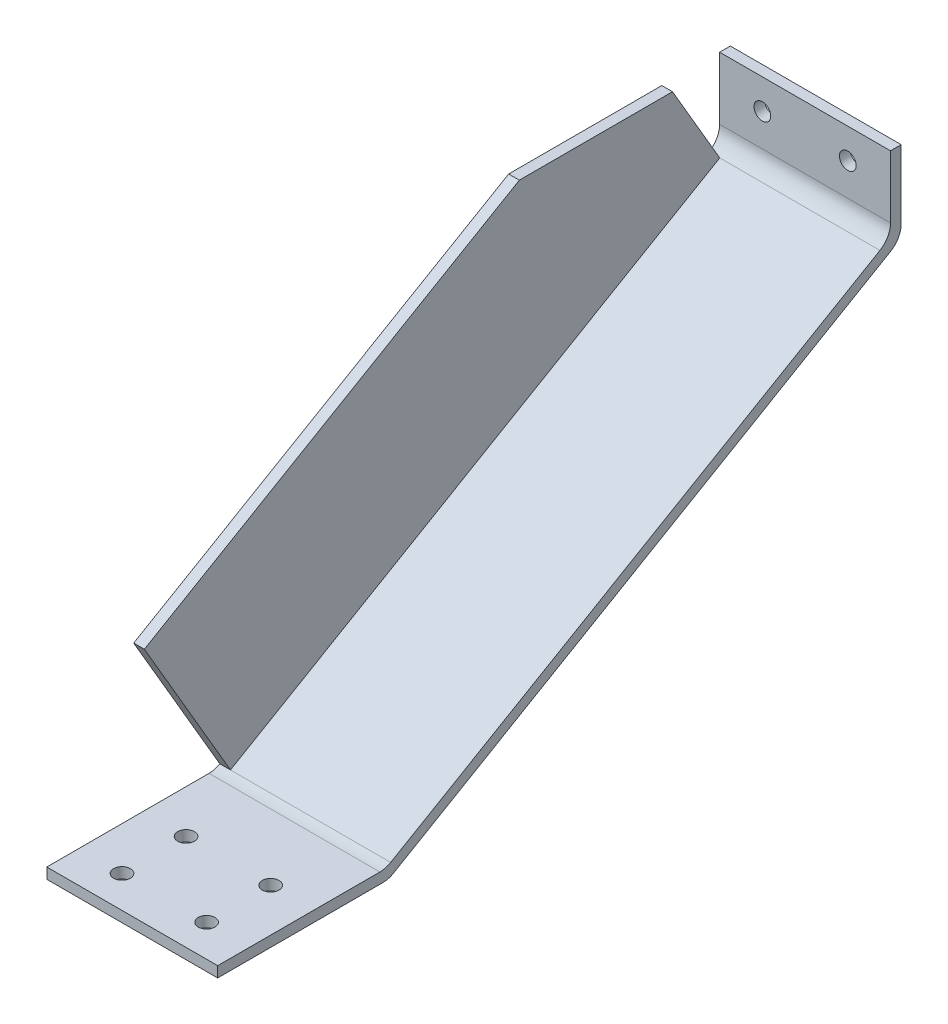
ISO-10303-21;
HEADER;
FILE_DESCRIPTION(('STEP AP214'),'2;1');
FILE_NAME('part.step','',(''),(''),'','','');
FILE_SCHEMA(('AUTOMOTIVE_DESIGN { 1 0 10303 214 1 1 1 1 }'));
ENDSEC;
DATA;
#1=APPLICATION_CONTEXT('core data for automotive mechanical design processes');
#2=APPLICATION_PROTOCOL_DEFINITION('international standard','automotive_design',2000,#1);
#3=PRODUCT_CONTEXT('',#1,'mechanical');
#4=PRODUCT('Part','Part','',(#3));
#5=PRODUCT_RELATED_PRODUCT_CATEGORY('part','',(#4));
#6=PRODUCT_DEFINITION_FORMATION('','',#4);
#7=PRODUCT_DEFINITION_CONTEXT('part definition',#1,'design');
#8=PRODUCT_DEFINITION('design','',#6,#7);
#9=PRODUCT_DEFINITION_SHAPE('','',#8);
#10=(LENGTH_UNIT() NAMED_UNIT(*) SI_UNIT(.MILLI.,.METRE.));
#11=(NAMED_UNIT(*) PLANE_ANGLE_UNIT() SI_UNIT($,.RADIAN.));
#12=(NAMED_UNIT(*) SI_UNIT($,.STERADIAN.) SOLID_ANGLE_UNIT());
#13=UNCERTAINTY_MEASURE_WITH_UNIT(LENGTH_MEASURE(1.E-05),#10,'distance_accuracy_value','');
#14=(GEOMETRIC_REPRESENTATION_CONTEXT(3) GLOBAL_UNCERTAINTY_ASSIGNED_CONTEXT((#13)) GLOBAL_UNIT_ASSIGNED_CONTEXT((#10,
#11,#12)) REPRESENTATION_CONTEXT('',''));
#15=CARTESIAN_POINT('',(0.,0.,0.));
#16=DIRECTION('',(0.,0.,1.));
#17=DIRECTION('',(1.,0.,0.));
#18=AXIS2_PLACEMENT_3D('',#15,#16,#17);
#19=CARTESIAN_POINT('',(3.175,0.,0.));
#20=DIRECTION('',(1.,0.,0.));
#21=DIRECTION('',(0.,0.,-1.));
#22=AXIS2_PLACEMENT_3D('',#19,#20,#21);
#23=PLANE('',#22);
#24=DIRECTION('',(0.,0.503871025524211,-0.863778900898361));
#25=VECTOR('',#24,1.);
#26=CARTESIAN_POINT('',(3.175,47.9199721449,177.372142656));
#27=LINE('',#26,#25);
#28=CARTESIAN_POINT('',(3.175,112.948625805791,65.8944506661171));
#29=VERTEX_POINT('',#28);
#30=CARTESIAN_POINT('',(3.175,47.9199721450679,177.372142655712));
#31=VERTEX_POINT('',#30);
#32=EDGE_CURVE('E233',#29,#31,#27,.F.);
#33=ORIENTED_EDGE('',*,*,#32,.T.);
#34=DIRECTION('',(0.,0.863778900898361,0.503871025524211));
#35=VECTOR('',#34,1.);
#36=CARTESIAN_POINT('',(3.175,4.04000397929,151.775494559));
#37=LINE('',#36,#35);
#38=CARTESIAN_POINT('',(3.175,4.04000397929314,151.775494559002));
#39=VERTEX_POINT('',#38);
#40=EDGE_CURVE('E220',#31,#39,#37,.F.);
#41=ORIENTED_EDGE('',*,*,#40,.T.);
#42=DIRECTION('',(0.,-0.503871025524211,0.863778900898361));
#43=VECTOR('',#42,1.);
#44=CARTESIAN_POINT('',(3.175,90.7236258055,3.175));
#45=LINE('',#44,#43);
#46=CARTESIAN_POINT('',(3.175,88.8858813959284,6.3254189878575));
#47=VERTEX_POINT('',#46);
#48=EDGE_CURVE('E104',#47,#39,#45,.T.);
#49=ORIENTED_EDGE('',*,*,#48,.F.);
#50=DIRECTION('',(0.,-0.863778900898361,-0.503871025524211));
#51=VECTOR('',#50,1.);
#52=CARTESIAN_POINT('',(3.175,112.948625806,20.3620198935));
#53=LINE('',#52,#51);
#54=CARTESIAN_POINT('',(3.175,112.948625806,20.3620198935));
#55=VERTEX_POINT('',#54);
#56=EDGE_CURVE('E244',#47,#55,#53,.F.);
#57=ORIENTED_EDGE('',*,*,#56,.T.);
#58=DIRECTION('',(0.,0.,1.));
#59=VECTOR('',#58,1.);
#60=CARTESIAN_POINT('',(3.175,112.948625806,0.));
#61=LINE('',#60,#59);
#62=EDGE_CURVE('E243',#29,#55,#61,.F.);
#63=ORIENTED_EDGE('',*,*,#62,.F.);
#64=EDGE_LOOP('',(#33,#41,#49,#57,#63));
#65=FACE_BOUND('',#64,.T.);
#66=ADVANCED_FACE('F17',(#65),#23,.T.);
#67=CARTESIAN_POINT('',(12.827,0.927499999389,174.625));
#68=DIRECTION('',(0.,1.,0.));
#69=DIRECTION('',(0.,0.,1.));
#70=AXIS2_PLACEMENT_3D('',#67,#68,#69);
#71=CYLINDRICAL_SURFACE('',#70,2.4892);
#72=CARTESIAN_POINT('',(12.827,3.175,174.625));
#73=DIRECTION('',(0.,1.,0.));
#74=DIRECTION('',(0.,0.,1.));
#75=AXIS2_PLACEMENT_3D('',#72,#73,#74);
#76=CIRCLE('',#75,2.4892);
#77=CARTESIAN_POINT('',(12.827,3.175,177.1142));
#78=VERTEX_POINT('',#77);
#79=EDGE_CURVE('E209',#78,#78,#76,.F.);
#80=ORIENTED_EDGE('',*,*,#79,.F.);
#81=EDGE_LOOP('',(#80));
#82=FACE_BOUND('',#81,.T.);
#83=CARTESIAN_POINT('',(12.827,0.,174.625));
#84=DIRECTION('',(0.,1.,0.));
#85=DIRECTION('',(0.,0.,1.));
#86=AXIS2_PLACEMENT_3D('',#83,#84,#85);
#87=CIRCLE('',#86,2.4892);
#88=CARTESIAN_POINT('',(12.827,0.,177.1142));
#89=VERTEX_POINT('',#88);
#90=EDGE_CURVE('E190',#89,#89,#87,.T.);
#91=ORIENTED_EDGE('',*,*,#90,.F.);
#92=EDGE_LOOP('',(#91));
#93=FACE_BOUND('',#92,.T.);
#94=ADVANCED_FACE('F335',(#82,#93),#71,.F.);
#95=CARTESIAN_POINT('',(12.827,0.927499999389,193.675));
#96=DIRECTION('',(0.,1.,0.));
#97=DIRECTION('',(0.,0.,1.));
#98=AXIS2_PLACEMENT_3D('',#95,#96,#97);
#99=CYLINDRICAL_SURFACE('',#98,2.4892);
#100=CARTESIAN_POINT('',(12.827,3.175,193.675));
#101=DIRECTION('',(0.,1.,0.));
#102=DIRECTION('',(0.,0.,1.));
#103=AXIS2_PLACEMENT_3D('',#100,#101,#102);
#104=CIRCLE('',#103,2.4892);
#105=CARTESIAN_POINT('',(12.827,3.175,196.1642));
#106=VERTEX_POINT('',#105);
#107=EDGE_CURVE('E327',#106,#106,#104,.F.);
#108=ORIENTED_EDGE('',*,*,#107,.F.);
#109=EDGE_LOOP('',(#108));
#110=FACE_BOUND('',#109,.T.);
#111=CARTESIAN_POINT('',(12.827,0.,193.675));
#112=DIRECTION('',(0.,1.,0.));
#113=DIRECTION('',(0.,0.,1.));
#114=AXIS2_PLACEMENT_3D('',#111,#112,#113);
#115=CIRCLE('',#114,2.4892);
#116=CARTESIAN_POINT('',(12.827,0.,196.1642));
#117=VERTEX_POINT('',#116);
#118=EDGE_CURVE('E317',#117,#117,#115,.T.);
#119=ORIENTED_EDGE('',*,*,#118,.F.);
#120=EDGE_LOOP('',(#119));
#121=FACE_BOUND('',#120,.T.);
#122=ADVANCED_FACE('F338',(#110,#121),#99,.F.);
#123=CARTESIAN_POINT('',(37.973,0.927499999389,193.675));
#124=DIRECTION('',(0.,1.,0.));
#125=DIRECTION('',(0.,0.,1.));
#126=AXIS2_PLACEMENT_3D('',#123,#124,#125);
#127=CYLINDRICAL_SURFACE('',#126,2.4892);
#128=CARTESIAN_POINT('',(37.973,3.175,193.675));
#129=DIRECTION('',(0.,1.,0.));
#130=DIRECTION('',(0.,0.,1.));
#131=AXIS2_PLACEMENT_3D('',#128,#129,#130);
#132=CIRCLE('',#131,2.4892);
#133=CARTESIAN_POINT('',(37.973,3.175,196.1642));
#134=VERTEX_POINT('',#133);
#135=EDGE_CURVE('E324',#134,#134,#132,.F.);
#136=ORIENTED_EDGE('',*,*,#135,.F.);
#137=EDGE_LOOP('',(#136));
#138=FACE_BOUND('',#137,.T.);
#139=CARTESIAN_POINT('',(37.973,0.,193.675));
#140=DIRECTION('',(0.,1.,0.));
#141=DIRECTION('',(0.,0.,1.));
#142=AXIS2_PLACEMENT_3D('',#139,#140,#141);
#143=CIRCLE('',#142,2.4892);
#144=CARTESIAN_POINT('',(37.973,0.,196.1642));
#145=VERTEX_POINT('',#144);
#146=EDGE_CURVE('E314',#145,#145,#143,.T.);
#147=ORIENTED_EDGE('',*,*,#146,.F.);
#148=EDGE_LOOP('',(#147));
#149=FACE_BOUND('',#148,.T.);
#150=ADVANCED_FACE('F603',(#138,#149),#127,.F.);
#151=CARTESIAN_POINT('',(37.973,0.927499999389,174.625));
#152=DIRECTION('',(0.,1.,0.));
#153=DIRECTION('',(0.,0.,1.));
#154=AXIS2_PLACEMENT_3D('',#151,#152,#153);
#155=CYLINDRICAL_SURFACE('',#154,2.4892);
#156=CARTESIAN_POINT('',(37.973,3.175,174.625));
#157=DIRECTION('',(0.,1.,0.));
#158=DIRECTION('',(0.,0.,1.));
#159=AXIS2_PLACEMENT_3D('',#156,#157,#158);
#160=CIRCLE('',#159,2.4892);
#161=CARTESIAN_POINT('',(37.973,3.175,177.1142));
#162=VERTEX_POINT('',#161);
#163=EDGE_CURVE('E204',#162,#162,#160,.F.);
#164=ORIENTED_EDGE('',*,*,#163,.F.);
#165=EDGE_LOOP('',(#164));
#166=FACE_BOUND('',#165,.T.);
#167=CARTESIAN_POINT('',(37.973,0.,174.625));
#168=DIRECTION('',(0.,1.,0.));
#169=DIRECTION('',(0.,0.,1.));
#170=AXIS2_PLACEMENT_3D('',#167,#168,#169);
#171=CIRCLE('',#170,2.4892);
#172=CARTESIAN_POINT('',(37.973,0.,177.1142));
#173=VERTEX_POINT('',#172);
#174=EDGE_CURVE('E311',#173,#173,#171,.T.);
#175=ORIENTED_EDGE('',*,*,#174,.F.);
#176=EDGE_LOOP('',(#175));
#177=FACE_BOUND('',#176,.T.);
#178=ADVANCED_FACE('F594',(#166,#177),#155,.F.);
#179=CARTESIAN_POINT('',(12.7,104.043701172,0.927499998937));
#180=DIRECTION('',(0.,0.,1.));
#181=DIRECTION('',(1.,0.,0.));
#182=AXIS2_PLACEMENT_3D('',#179,#180,#181);
#183=CYLINDRICAL_SURFACE('',#182,2.4892);
#184=CARTESIAN_POINT('',(12.7,104.043701172,3.175));
#185=DIRECTION('',(0.,0.,1.));
#186=DIRECTION('',(1.,0.,0.));
#187=AXIS2_PLACEMENT_3D('',#184,#185,#186);
#188=CIRCLE('',#187,2.4892);
#189=CARTESIAN_POINT('',(15.1892,104.043701172,3.175));
#190=VERTEX_POINT('',#189);
#191=EDGE_CURVE('E158',#190,#190,#188,.F.);
#192=ORIENTED_EDGE('',*,*,#191,.F.);
#193=EDGE_LOOP('',(#192));
#194=FACE_BOUND('',#193,.T.);
#195=CARTESIAN_POINT('',(12.7,104.043701172,0.));
#196=DIRECTION('',(0.,0.,1.));
#197=DIRECTION('',(1.,0.,0.));
#198=AXIS2_PLACEMENT_3D('',#195,#196,#197);
#199=CIRCLE('',#198,2.4892);
#200=CARTESIAN_POINT('',(15.1892,104.043701172,0.));
#201=VERTEX_POINT('',#200);
#202=EDGE_CURVE('E178',#201,#201,#199,.T.);
#203=ORIENTED_EDGE('',*,*,#202,.F.);
#204=EDGE_LOOP('',(#203));
#205=FACE_BOUND('',#204,.T.);
#206=ADVANCED_FACE('F585',(#194,#205),#183,.F.);
#207=CARTESIAN_POINT('',(38.1,104.043701172,0.927499998937));
#208=DIRECTION('',(0.,0.,1.));
#209=DIRECTION('',(1.,0.,0.));
#210=AXIS2_PLACEMENT_3D('',#207,#208,#209);
#211=CYLINDRICAL_SURFACE('',#210,2.4892);
#212=CARTESIAN_POINT('',(38.1,104.043701172,3.175));
#213=DIRECTION('',(0.,0.,1.));
#214=DIRECTION('',(1.,0.,0.));
#215=AXIS2_PLACEMENT_3D('',#212,#213,#214);
#216=CIRCLE('',#215,2.4892);
#217=CARTESIAN_POINT('',(40.5892,104.043701172,3.175));
#218=VERTEX_POINT('',#217);
#219=EDGE_CURVE('E161',#218,#218,#216,.F.);
#220=ORIENTED_EDGE('',*,*,#219,.F.);
#221=EDGE_LOOP('',(#220));
#222=FACE_BOUND('',#221,.T.);
#223=CARTESIAN_POINT('',(38.1,104.043701172,0.));
#224=DIRECTION('',(0.,0.,1.));
#225=DIRECTION('',(1.,0.,0.));
#226=AXIS2_PLACEMENT_3D('',#223,#224,#225);
#227=CIRCLE('',#226,2.4892);
#228=CARTESIAN_POINT('',(40.5892,104.043701172,0.));
#229=VERTEX_POINT('',#228);
#230=EDGE_CURVE('E173',#229,#229,#227,.T.);
#231=ORIENTED_EDGE('',*,*,#230,.F.);
#232=EDGE_LOOP('',(#231));
#233=FACE_BOUND('',#232,.T.);
#234=ADVANCED_FACE('F434',(#222,#233),#211,.F.);
#235=CARTESIAN_POINT('',(50.8,0.,0.));
#236=DIRECTION('',(1.,0.,0.));
#237=DIRECTION('',(0.,0.,-1.));
#238=AXIS2_PLACEMENT_3D('',#235,#236,#237);
#239=PLANE('',#238);
#240=DIRECTION('',(0.,0.503871025524211,-0.863778900898361));
#241=VECTOR('',#240,1.);
#242=CARTESIAN_POINT('',(50.8,0.,152.4));
#243=LINE('',#242,#241);
#244=CARTESIAN_POINT('',(50.8,87.062255590401,3.15041898792254));
#245=VERTEX_POINT('',#244);
#246=CARTESIAN_POINT('',(50.8,0.865003979309899,150.917136035469));
#247=VERTEX_POINT('',#246);
#248=EDGE_CURVE('E184',#245,#247,#243,.F.);
#249=ORIENTED_EDGE('',*,*,#248,.F.);
#250=CARTESIAN_POINT('',(50.8,92.5472516111,6.35));
#251=DIRECTION('',(1.,0.,0.));
#252=DIRECTION('',(0.,0.,-1.));
#253=AXIS2_PLACEMENT_3D('',#250,#251,#252);
#254=CIRCLE('',#253,6.35);
#255=CARTESIAN_POINT('',(50.8,92.5472516111,0.));
#256=VERTEX_POINT('',#255);
#257=EDGE_CURVE('E181',#256,#245,#254,.F.);
#258=ORIENTED_EDGE('',*,*,#257,.F.);
#259=DIRECTION('',(0.,1.,0.));
#260=VECTOR('',#259,1.);
#261=CARTESIAN_POINT('',(50.8,88.9,0.));
#262=LINE('',#261,#260);
#263=CARTESIAN_POINT('',(50.8,112.948625806,0.));
#264=VERTEX_POINT('',#263);
#265=EDGE_CURVE('E149',#264,#256,#262,.F.);
#266=ORIENTED_EDGE('',*,*,#265,.F.);
#267=DIRECTION('',(0.,0.,1.));
#268=VECTOR('',#267,1.);
#269=CARTESIAN_POINT('',(50.8,112.948625806,0.));
#270=LINE('',#269,#268);
#271=CARTESIAN_POINT('',(50.8,112.948625806,3.175));
#272=VERTEX_POINT('',#271);
#273=EDGE_CURVE('E143',#272,#264,#270,.F.);
#274=ORIENTED_EDGE('',*,*,#273,.F.);
#275=DIRECTION('',(0.,1.,0.));
#276=VECTOR('',#275,1.);
#277=CARTESIAN_POINT('',(50.8,112.948625806,3.175));
#278=LINE('',#277,#276);
#279=CARTESIAN_POINT('',(50.8,94.3708774166,3.175));
#280=VERTEX_POINT('',#279);
#281=EDGE_CURVE('E136',#280,#272,#278,.T.);
#282=ORIENTED_EDGE('',*,*,#281,.F.);
#283=CARTESIAN_POINT('',(50.8,94.3708774166,9.525));
#284=DIRECTION('',(1.,0.,0.));
#285=DIRECTION('',(0.,0.,-1.));
#286=AXIS2_PLACEMENT_3D('',#283,#284,#285);
#287=CIRCLE('',#286,6.35);
#288=CARTESIAN_POINT('',(50.8,88.88588139589,6.32541898791615));
#289=VERTEX_POINT('',#288);
#290=EDGE_CURVE('E253',#280,#289,#287,.F.);
#291=ORIENTED_EDGE('',*,*,#290,.T.);
#292=DIRECTION('',(0.,-0.503871025524211,0.863778900898361));
#293=VECTOR('',#292,1.);
#294=CARTESIAN_POINT('',(50.8,90.7236258055,3.175));
#295=LINE('',#294,#293);
#296=CARTESIAN_POINT('',(50.8,4.04000397932926,151.775494558982));
#297=VERTEX_POINT('',#296);
#298=EDGE_CURVE('E94',#297,#289,#295,.F.);
#299=ORIENTED_EDGE('',*,*,#298,.F.);
#300=CARTESIAN_POINT('',(50.8,9.525,154.975075571));
#301=DIRECTION('',(1.,0.,0.));
#302=DIRECTION('',(0.,0.,-1.));
#303=AXIS2_PLACEMENT_3D('',#300,#301,#302);
#304=CIRCLE('',#303,6.35);
#305=CARTESIAN_POINT('',(50.8,3.175,154.975075571));
#306=VERTEX_POINT('',#305);
#307=EDGE_CURVE('E20',#297,#306,#304,.F.);
#308=ORIENTED_EDGE('',*,*,#307,.T.);
#309=DIRECTION('',(0.,0.,1.));
#310=VECTOR('',#309,1.);
#311=CARTESIAN_POINT('',(50.8,3.175,153.258358524));
#312=LINE('',#311,#310);
#313=CARTESIAN_POINT('',(50.8,3.175,203.2));
#314=VERTEX_POINT('',#313);
#315=EDGE_CURVE('E210',#314,#306,#312,.F.);
#316=ORIENTED_EDGE('',*,*,#315,.F.);
#317=DIRECTION('',(0.,1.,0.));
#318=VECTOR('',#317,1.);
#319=CARTESIAN_POINT('',(50.8,3.175,203.2));
#320=LINE('',#319,#318);
#321=CARTESIAN_POINT('',(50.8,0.,203.2));
#322=VERTEX_POINT('',#321);
#323=EDGE_CURVE('E203',#322,#314,#320,.T.);
#324=ORIENTED_EDGE('',*,*,#323,.F.);
#325=DIRECTION('',(0.,0.,-1.));
#326=VECTOR('',#325,1.);
#327=CARTESIAN_POINT('',(50.8,0.,203.2));
#328=LINE('',#327,#326);
#329=CARTESIAN_POINT('',(50.8,0.,154.116717048));
#330=VERTEX_POINT('',#329);
#331=EDGE_CURVE('E191',#330,#322,#328,.F.);
#332=ORIENTED_EDGE('',*,*,#331,.F.);
#333=CARTESIAN_POINT('',(50.8,6.35,154.116717048));
#334=DIRECTION('',(1.,0.,0.));
#335=DIRECTION('',(0.,0.,-1.));
#336=AXIS2_PLACEMENT_3D('',#333,#334,#335);
#337=CIRCLE('',#336,6.35);
#338=EDGE_CURVE('E187',#247,#330,#337,.F.);
#339=ORIENTED_EDGE('',*,*,#338,.F.);
#340=EDGE_LOOP('',(#249,#258,#266,#274,#282,#291,#299,#308,#316,#324,#332,#339));
#341=FACE_BOUND('',#340,.T.);
#342=ADVANCED_FACE('F147',(#341),#239,.T.);
#343=CARTESIAN_POINT('',(0.,90.7236258055,3.175));
#344=DIRECTION('',(0.,0.863778900898361,0.503871025524211));
#345=DIRECTION('',(0.,-0.503871025524211,0.863778900898361));
#346=AXIS2_PLACEMENT_3D('',#343,#344,#345);
#347=PLANE('',#346);
#348=DIRECTION('',(1.,0.,0.));
#349=VECTOR('',#348,1.);
#350=CARTESIAN_POINT('',(25.4,88.8858813958971,6.32541898791832));
#351=LINE('',#350,#349);
#352=EDGE_CURVE('E250',#289,#47,#351,.F.);
#353=ORIENTED_EDGE('',*,*,#352,.T.);
#354=ORIENTED_EDGE('',*,*,#48,.T.);
#355=DIRECTION('',(1.,0.,0.));
#356=VECTOR('',#355,1.);
#357=CARTESIAN_POINT('',(25.4,4.04000397925975,151.775494558982));
#358=LINE('',#357,#356);
#359=EDGE_CURVE('E214',#39,#297,#358,.T.);
#360=ORIENTED_EDGE('',*,*,#359,.T.);
#361=ORIENTED_EDGE('',*,*,#298,.T.);
#362=EDGE_LOOP('',(#353,#354,#360,#361));
#363=FACE_BOUND('',#362,.T.);
#364=ADVANCED_FACE('F425',(#363),#347,.T.);
#365=CARTESIAN_POINT('',(0.,112.948625806,20.3620198935));
#366=DIRECTION('',(0.,-0.503871025524211,0.863778900898361));
#367=DIRECTION('',(0.,-0.863778900898361,-0.503871025524211));
#368=AXIS2_PLACEMENT_3D('',#365,#366,#367);
#369=PLANE('',#368);
#370=DIRECTION('',(0.,0.863778900903303,0.503871025515739));
#371=VECTOR('',#370,1.);
#372=CARTESIAN_POINT('',(0.,88.8858813959,6.32541898792));
#373=LINE('',#372,#371);
#374=CARTESIAN_POINT('',(0.,88.8858813958971,6.32541898791832));
#375=VERTEX_POINT('',#374);
#376=CARTESIAN_POINT('',(0.,112.948625806,20.3620198935));
#377=VERTEX_POINT('',#376);
#378=EDGE_CURVE('E238',#375,#377,#373,.T.);
#379=ORIENTED_EDGE('',*,*,#378,.T.);
#380=DIRECTION('',(1.,0.,0.));
#381=VECTOR('',#380,1.);
#382=CARTESIAN_POINT('',(0.,112.948625806,20.3620198935));
#383=LINE('',#382,#381);
#384=EDGE_CURVE('E241',#55,#377,#383,.F.);
#385=ORIENTED_EDGE('',*,*,#384,.F.);
#386=ORIENTED_EDGE('',*,*,#56,.F.);
#387=DIRECTION('',(1.,0.,0.));
#388=VECTOR('',#387,1.);
#389=CARTESIAN_POINT('',(25.4,88.8858813958971,6.32541898791832));
#390=LINE('',#389,#388);
#391=EDGE_CURVE('E252',#47,#375,#390,.F.);
#392=ORIENTED_EDGE('',*,*,#391,.T.);
#393=EDGE_LOOP('',(#379,#385,#386,#392));
#394=FACE_BOUND('',#393,.T.);
#395=ADVANCED_FACE('F378',(#394),#369,.F.);
#396=CARTESIAN_POINT('',(0.,112.948625806,0.));
#397=DIRECTION('',(0.,1.,0.));
#398=DIRECTION('',(0.,0.,1.));
#399=AXIS2_PLACEMENT_3D('',#396,#397,#398);
#400=PLANE('',#399);
#401=DIRECTION('',(1.,0.,0.));
#402=VECTOR('',#401,1.);
#403=CARTESIAN_POINT('',(0.,112.948625805687,65.8944506661171));
#404=LINE('',#403,#402);
#405=CARTESIAN_POINT('',(0.,112.948625805896,65.8944506662391));
#406=VERTEX_POINT('',#405);
#407=EDGE_CURVE('E230',#406,#29,#404,.T.);
#408=ORIENTED_EDGE('',*,*,#407,.T.);
#409=ORIENTED_EDGE('',*,*,#62,.T.);
#410=ORIENTED_EDGE('',*,*,#384,.T.);
#411=DIRECTION('',(0.,0.,-1.));
#412=VECTOR('',#411,1.);
#413=CARTESIAN_POINT('',(0.,112.948625806,0.));
#414=LINE('',#413,#412);
#415=EDGE_CURVE('E227',#377,#406,#414,.F.);
#416=ORIENTED_EDGE('',*,*,#415,.T.);
#417=EDGE_LOOP('',(#408,#409,#410,#416));
#418=FACE_BOUND('',#417,.T.);
#419=ADVANCED_FACE('F423',(#418),#400,.T.);
#420=CARTESIAN_POINT('',(0.,47.9199721449,177.372142656));
#421=DIRECTION('',(0.,-0.863778900898361,-0.503871025524211));
#422=DIRECTION('',(0.,0.503871025524211,-0.863778900898361));
#423=AXIS2_PLACEMENT_3D('',#420,#421,#422);
#424=PLANE('',#423);
#425=DIRECTION('',(0.,-0.50387102552664,0.863778900896944));
#426=VECTOR('',#425,1.);
#427=CARTESIAN_POINT('',(0.,112.948625806,65.8944506663));
#428=LINE('',#427,#426);
#429=CARTESIAN_POINT('',(0.,47.9199721449559,177.372142655904));
#430=VERTEX_POINT('',#429);
#431=EDGE_CURVE('E223',#406,#430,#428,.T.);
#432=ORIENTED_EDGE('',*,*,#431,.T.);
#433=DIRECTION('',(1.,0.,0.));
#434=VECTOR('',#433,1.);
#435=CARTESIAN_POINT('',(0.,47.9199721450679,177.372142655712));
#436=LINE('',#435,#434);
#437=EDGE_CURVE('E215',#430,#31,#436,.T.);
#438=ORIENTED_EDGE('',*,*,#437,.T.);
#439=ORIENTED_EDGE('',*,*,#32,.F.);
#440=ORIENTED_EDGE('',*,*,#407,.F.);
#441=EDGE_LOOP('',(#432,#438,#439,#440));
#442=FACE_BOUND('',#441,.T.);
#443=ADVANCED_FACE('F420',(#442),#424,.F.);
#444=CARTESIAN_POINT('',(0.,4.04000397929,151.775494559));
#445=DIRECTION('',(0.,0.503871025524211,-0.863778900898361));
#446=DIRECTION('',(0.,0.863778900898361,0.503871025524211));
#447=AXIS2_PLACEMENT_3D('',#444,#445,#446);
#448=PLANE('',#447);
#449=DIRECTION('',(0.,-0.863778900895057,-0.503871025529875));
#450=VECTOR('',#449,1.);
#451=CARTESIAN_POINT('',(0.,47.9199721449,177.372142656));
#452=LINE('',#451,#450);
#453=CARTESIAN_POINT('',(0.,4.04000397925975,151.775494558982));
#454=VERTEX_POINT('',#453);
#455=EDGE_CURVE('E226',#430,#454,#452,.T.);
#456=ORIENTED_EDGE('',*,*,#455,.T.);
#457=DIRECTION('',(1.,0.,0.));
#458=VECTOR('',#457,1.);
#459=CARTESIAN_POINT('',(25.4,4.04000397925975,151.775494558982));
#460=LINE('',#459,#458);
#461=EDGE_CURVE('E211',#454,#39,#460,.T.);
#462=ORIENTED_EDGE('',*,*,#461,.T.);
#463=ORIENTED_EDGE('',*,*,#40,.F.);
#464=ORIENTED_EDGE('',*,*,#437,.F.);
#465=EDGE_LOOP('',(#456,#462,#463,#464));
#466=FACE_BOUND('',#465,.T.);
#467=ADVANCED_FACE('F418',(#466),#448,.F.);
#468=CARTESIAN_POINT('',(25.4,9.525,154.975075571));
#469=DIRECTION('',(1.,0.,0.));
#470=DIRECTION('',(0.,0.,-1.));
#471=AXIS2_PLACEMENT_3D('',#468,#469,#470);
#472=CYLINDRICAL_SURFACE('',#471,6.35);
#473=ORIENTED_EDGE('',*,*,#307,.F.);
#474=ORIENTED_EDGE('',*,*,#359,.F.);
#475=ORIENTED_EDGE('',*,*,#461,.F.);
#476=CARTESIAN_POINT('',(0.,9.525,154.975075571));
#477=DIRECTION('',(1.,0.,0.));
#478=DIRECTION('',(0.,0.,-1.));
#479=AXIS2_PLACEMENT_3D('',#476,#477,#478);
#480=CIRCLE('',#479,6.35);
#481=CARTESIAN_POINT('',(0.,3.175,154.975075571));
#482=VERTEX_POINT('',#481);
#483=EDGE_CURVE('E299',#454,#482,#480,.F.);
#484=ORIENTED_EDGE('',*,*,#483,.T.);
#485=DIRECTION('',(1.,0.,0.));
#486=VECTOR('',#485,1.);
#487=CARTESIAN_POINT('',(0.,3.175,154.975075571));
#488=LINE('',#487,#486);
#489=EDGE_CURVE('E207',#306,#482,#488,.F.);
#490=ORIENTED_EDGE('',*,*,#489,.F.);
#491=EDGE_LOOP('',(#473,#474,#475,#484,#490));
#492=FACE_BOUND('',#491,.T.);
#493=ADVANCED_FACE('F413',(#492),#472,.F.);
#494=CARTESIAN_POINT('',(0.,3.175,153.258358524));
#495=DIRECTION('',(0.,1.,0.));
#496=DIRECTION('',(0.,0.,1.));
#497=AXIS2_PLACEMENT_3D('',#494,#495,#496);
#498=PLANE('',#497);
#499=ORIENTED_EDGE('',*,*,#163,.T.);
#500=EDGE_LOOP('',(#499));
#501=FACE_BOUND('',#500,.T.);
#502=ORIENTED_EDGE('',*,*,#135,.T.);
#503=EDGE_LOOP('',(#502));
#504=FACE_BOUND('',#503,.T.);
#505=ORIENTED_EDGE('',*,*,#107,.T.);
#506=EDGE_LOOP('',(#505));
#507=FACE_BOUND('',#506,.T.);
#508=ORIENTED_EDGE('',*,*,#79,.T.);
#509=EDGE_LOOP('',(#508));
#510=FACE_BOUND('',#509,.T.);
#511=ORIENTED_EDGE('',*,*,#315,.T.);
#512=ORIENTED_EDGE('',*,*,#489,.T.);
#513=DIRECTION('',(0.,0.,-1.));
#514=VECTOR('',#513,1.);
#515=CARTESIAN_POINT('',(0.,3.175,0.));
#516=LINE('',#515,#514);
#517=CARTESIAN_POINT('',(0.,3.175,203.2));
#518=VERTEX_POINT('',#517);
#519=EDGE_CURVE('E198',#482,#518,#516,.F.);
#520=ORIENTED_EDGE('',*,*,#519,.T.);
#521=DIRECTION('',(1.,0.,0.));
#522=VECTOR('',#521,1.);
#523=CARTESIAN_POINT('',(0.,3.175,203.2));
#524=LINE('',#523,#522);
#525=EDGE_CURVE('E201',#314,#518,#524,.F.);
#526=ORIENTED_EDGE('',*,*,#525,.F.);
#527=EDGE_LOOP('',(#511,#512,#520,#526));
#528=FACE_BOUND('',#527,.T.);
#529=ADVANCED_FACE('F332',(#501,#504,#507,#510,#528),#498,.T.);
#530=CARTESIAN_POINT('',(0.,3.175,203.2));
#531=DIRECTION('',(0.,0.,1.));
#532=DIRECTION('',(1.,0.,0.));
#533=AXIS2_PLACEMENT_3D('',#530,#531,#532);
#534=PLANE('',#533);
#535=DIRECTION('',(1.,0.,0.));
#536=VECTOR('',#535,1.);
#537=CARTESIAN_POINT('',(0.,0.,203.2));
#538=LINE('',#537,#536);
#539=CARTESIAN_POINT('',(0.,0.,203.2));
#540=VERTEX_POINT('',#539);
#541=EDGE_CURVE('E188',#322,#540,#538,.F.);
#542=ORIENTED_EDGE('',*,*,#541,.F.);
#543=ORIENTED_EDGE('',*,*,#323,.T.);
#544=ORIENTED_EDGE('',*,*,#525,.T.);
#545=DIRECTION('',(0.,1.,0.));
#546=VECTOR('',#545,1.);
#547=CARTESIAN_POINT('',(0.,0.,203.2));
#548=LINE('',#547,#546);
#549=EDGE_CURVE('E194',#518,#540,#548,.F.);
#550=ORIENTED_EDGE('',*,*,#549,.T.);
#551=EDGE_LOOP('',(#542,#543,#544,#550));
#552=FACE_BOUND('',#551,.T.);
#553=ADVANCED_FACE('F345',(#552),#534,.T.);
#554=CARTESIAN_POINT('',(0.,0.,203.2));
#555=DIRECTION('',(0.,-1.,0.));
#556=DIRECTION('',(0.,0.,-1.));
#557=AXIS2_PLACEMENT_3D('',#554,#555,#556);
#558=PLANE('',#557);
#559=ORIENTED_EDGE('',*,*,#174,.T.);
#560=EDGE_LOOP('',(#559));
#561=FACE_BOUND('',#560,.T.);
#562=ORIENTED_EDGE('',*,*,#146,.T.);
#563=EDGE_LOOP('',(#562));
#564=FACE_BOUND('',#563,.T.);
#565=ORIENTED_EDGE('',*,*,#118,.T.);
#566=EDGE_LOOP('',(#565));
#567=FACE_BOUND('',#566,.T.);
#568=ORIENTED_EDGE('',*,*,#90,.T.);
#569=EDGE_LOOP('',(#568));
#570=FACE_BOUND('',#569,.T.);
#571=DIRECTION('',(0.,0.,-1.));
#572=VECTOR('',#571,1.);
#573=CARTESIAN_POINT('',(0.,0.,0.));
#574=LINE('',#573,#572);
#575=CARTESIAN_POINT('',(0.,0.,154.116717048));
#576=VERTEX_POINT('',#575);
#577=EDGE_CURVE('E197',#540,#576,#574,.T.);
#578=ORIENTED_EDGE('',*,*,#577,.T.);
#579=DIRECTION('',(1.,0.,0.));
#580=VECTOR('',#579,1.);
#581=CARTESIAN_POINT('',(25.4,0.,154.116717048));
#582=LINE('',#581,#580);
#583=EDGE_CURVE('E185',#330,#576,#582,.F.);
#584=ORIENTED_EDGE('',*,*,#583,.F.);
#585=ORIENTED_EDGE('',*,*,#331,.T.);
#586=ORIENTED_EDGE('',*,*,#541,.T.);
#587=EDGE_LOOP('',(#578,#584,#585,#586));
#588=FACE_BOUND('',#587,.T.);
#589=ADVANCED_FACE('F341',(#561,#564,#567,#570,#588),#558,.T.);
#590=CARTESIAN_POINT('',(25.4,6.35,154.116717048));
#591=DIRECTION('',(1.,0.,0.));
#592=DIRECTION('',(0.,0.,-1.));
#593=AXIS2_PLACEMENT_3D('',#590,#591,#592);
#594=CYLINDRICAL_SURFACE('',#593,6.35);
#595=CARTESIAN_POINT('',(0.,6.35,154.116717048));
#596=DIRECTION('',(1.,0.,0.));
#597=DIRECTION('',(0.,0.,-1.));
#598=AXIS2_PLACEMENT_3D('',#595,#596,#597);
#599=CIRCLE('',#598,6.35);
#600=CARTESIAN_POINT('',(0.,0.865003979204497,150.917136035403));
#601=VERTEX_POINT('',#600);
#602=EDGE_CURVE('E296',#576,#601,#599,.T.);
#603=ORIENTED_EDGE('',*,*,#602,.T.);
#604=DIRECTION('',(1.,0.,0.));
#605=VECTOR('',#604,1.);
#606=CARTESIAN_POINT('',(0.,0.865003979510332,150.917136035126));
#607=LINE('',#606,#605);
#608=EDGE_CURVE('E182',#247,#601,#607,.F.);
#609=ORIENTED_EDGE('',*,*,#608,.F.);
#610=ORIENTED_EDGE('',*,*,#338,.T.);
#611=ORIENTED_EDGE('',*,*,#583,.T.);
#612=EDGE_LOOP('',(#603,#609,#610,#611));
#613=FACE_BOUND('',#612,.T.);
#614=ADVANCED_FACE('F344',(#613),#594,.T.);
#615=CARTESIAN_POINT('',(0.,0.,152.4));
#616=DIRECTION('',(0.,-0.863778900898361,-0.503871025524211));
#617=DIRECTION('',(0.,0.503871025524211,-0.863778900898361));
#618=AXIS2_PLACEMENT_3D('',#615,#616,#617);
#619=PLANE('',#618);
#620=DIRECTION('',(0.,0.503871025525431,-0.863778900897649));
#621=VECTOR('',#620,1.);
#622=CARTESIAN_POINT('',(0.,0.865003979295,150.917136035));
#623=LINE('',#622,#621);
#624=CARTESIAN_POINT('',(0.,87.0622555904,3.15041898791676));
#625=VERTEX_POINT('',#624);
#626=EDGE_CURVE('E295',#601,#625,#623,.T.);
#627=ORIENTED_EDGE('',*,*,#626,.T.);
#628=DIRECTION('',(1.,0.,0.));
#629=VECTOR('',#628,1.);
#630=CARTESIAN_POINT('',(25.4,87.0622555903971,3.15041898791832));
#631=LINE('',#630,#629);
#632=EDGE_CURVE('E179',#245,#625,#631,.F.);
#633=ORIENTED_EDGE('',*,*,#632,.F.);
#634=ORIENTED_EDGE('',*,*,#248,.T.);
#635=ORIENTED_EDGE('',*,*,#608,.T.);
#636=EDGE_LOOP('',(#627,#633,#634,#635));
#637=FACE_BOUND('',#636,.T.);
#638=ADVANCED_FACE('F401',(#637),#619,.T.);
#639=CARTESIAN_POINT('',(25.4,92.5472516111,6.35));
#640=DIRECTION('',(1.,0.,0.));
#641=DIRECTION('',(0.,0.,-1.));
#642=AXIS2_PLACEMENT_3D('',#639,#640,#641);
#643=CYLINDRICAL_SURFACE('',#642,6.35);
#644=CARTESIAN_POINT('',(0.,92.5472516111,6.35));
#645=DIRECTION('',(1.,0.,0.));
#646=DIRECTION('',(0.,0.,-1.));
#647=AXIS2_PLACEMENT_3D('',#644,#645,#646);
#648=CIRCLE('',#647,6.35);
#649=CARTESIAN_POINT('',(0.,92.5472516111,0.));
#650=VERTEX_POINT('',#649);
#651=EDGE_CURVE('E292',#625,#650,#648,.T.);
#652=ORIENTED_EDGE('',*,*,#651,.T.);
#653=DIRECTION('',(-1.,0.,0.));
#654=VECTOR('',#653,1.);
#655=CARTESIAN_POINT('',(0.,92.5472516111,0.));
#656=LINE('',#655,#654);
#657=EDGE_CURVE('E176',#256,#650,#656,.T.);
#658=ORIENTED_EDGE('',*,*,#657,.F.);
#659=ORIENTED_EDGE('',*,*,#257,.T.);
#660=ORIENTED_EDGE('',*,*,#632,.T.);
#661=EDGE_LOOP('',(#652,#658,#659,#660));
#662=FACE_BOUND('',#661,.T.);
#663=ADVANCED_FACE('F398',(#662),#643,.T.);
#664=CARTESIAN_POINT('',(0.,88.9,0.));
#665=DIRECTION('',(0.,0.,-1.));
#666=DIRECTION('',(-1.,0.,0.));
#667=AXIS2_PLACEMENT_3D('',#664,#665,#666);
#668=PLANE('',#667);
#669=ORIENTED_EDGE('',*,*,#230,.T.);
#670=EDGE_LOOP('',(#669));
#671=FACE_BOUND('',#670,.T.);
#672=ORIENTED_EDGE('',*,*,#202,.T.);
#673=EDGE_LOOP('',(#672));
#674=FACE_BOUND('',#673,.T.);
#675=ORIENTED_EDGE('',*,*,#265,.T.);
#676=ORIENTED_EDGE('',*,*,#657,.T.);
#677=DIRECTION('',(0.,1.,0.));
#678=VECTOR('',#677,1.);
#679=CARTESIAN_POINT('',(0.,0.,0.));
#680=LINE('',#679,#678);
#681=CARTESIAN_POINT('',(0.,112.948625806,0.));
#682=VERTEX_POINT('',#681);
#683=EDGE_CURVE('E169',#650,#682,#680,.T.);
#684=ORIENTED_EDGE('',*,*,#683,.T.);
#685=DIRECTION('',(1.,0.,0.));
#686=VECTOR('',#685,1.);
#687=CARTESIAN_POINT('',(0.,112.948625806,0.));
#688=LINE('',#687,#686);
#689=EDGE_CURVE('E152',#264,#682,#688,.F.);
#690=ORIENTED_EDGE('',*,*,#689,.F.);
#691=EDGE_LOOP('',(#675,#676,#684,#690));
#692=FACE_BOUND('',#691,.T.);
#693=ADVANCED_FACE('F392',(#671,#674,#692),#668,.T.);
#694=CARTESIAN_POINT('',(0.,112.948625806,0.));
#695=DIRECTION('',(0.,1.,0.));
#696=DIRECTION('',(0.,0.,1.));
#697=AXIS2_PLACEMENT_3D('',#694,#695,#696);
#698=PLANE('',#697);
#699=DIRECTION('',(1.,0.,0.));
#700=VECTOR('',#699,1.);
#701=CARTESIAN_POINT('',(0.,112.948625806,3.175));
#702=LINE('',#701,#700);
#703=CARTESIAN_POINT('',(0.,112.948625806,3.175));
#704=VERTEX_POINT('',#703);
#705=EDGE_CURVE('E141',#272,#704,#702,.F.);
#706=ORIENTED_EDGE('',*,*,#705,.F.);
#707=ORIENTED_EDGE('',*,*,#273,.T.);
#708=ORIENTED_EDGE('',*,*,#689,.T.);
#709=DIRECTION('',(0.,0.,-1.));
#710=VECTOR('',#709,1.);
#711=CARTESIAN_POINT('',(0.,112.948625806,0.));
#712=LINE('',#711,#710);
#713=EDGE_CURVE('E157',#682,#704,#712,.F.);
#714=ORIENTED_EDGE('',*,*,#713,.T.);
#715=EDGE_LOOP('',(#706,#707,#708,#714));
#716=FACE_BOUND('',#715,.T.);
#717=ADVANCED_FACE('F155',(#716),#698,.T.);
#718=CARTESIAN_POINT('',(0.,112.948625806,3.175));
#719=DIRECTION('',(0.,0.,1.));
#720=DIRECTION('',(1.,0.,0.));
#721=AXIS2_PLACEMENT_3D('',#718,#719,#720);
#722=PLANE('',#721);
#723=ORIENTED_EDGE('',*,*,#219,.T.);
#724=EDGE_LOOP('',(#723));
#725=FACE_BOUND('',#724,.T.);
#726=ORIENTED_EDGE('',*,*,#191,.T.);
#727=EDGE_LOOP('',(#726));
#728=FACE_BOUND('',#727,.T.);
#729=DIRECTION('',(0.,1.,0.));
#730=VECTOR('',#729,1.);
#731=CARTESIAN_POINT('',(0.,0.,3.175));
#732=LINE('',#731,#730);
#733=CARTESIAN_POINT('',(0.,94.3708774166,3.175));
#734=VERTEX_POINT('',#733);
#735=EDGE_CURVE('E26',#704,#734,#732,.F.);
#736=ORIENTED_EDGE('',*,*,#735,.T.);
#737=DIRECTION('',(1.,0.,0.));
#738=VECTOR('',#737,1.);
#739=CARTESIAN_POINT('',(25.4,94.3708774166,3.175));
#740=LINE('',#739,#738);
#741=EDGE_CURVE('E34',#734,#280,#740,.T.);
#742=ORIENTED_EDGE('',*,*,#741,.T.);
#743=ORIENTED_EDGE('',*,*,#281,.T.);
#744=ORIENTED_EDGE('',*,*,#705,.T.);
#745=EDGE_LOOP('',(#736,#742,#743,#744));
#746=FACE_BOUND('',#745,.T.);
#747=ADVANCED_FACE('F139',(#725,#728,#746),#722,.T.);
#748=CARTESIAN_POINT('',(25.4,94.3708774166,9.525));
#749=DIRECTION('',(1.,0.,0.));
#750=DIRECTION('',(0.,0.,-1.));
#751=AXIS2_PLACEMENT_3D('',#748,#749,#750);
#752=CYLINDRICAL_SURFACE('',#751,6.35);
#753=ORIENTED_EDGE('',*,*,#352,.F.);
#754=ORIENTED_EDGE('',*,*,#290,.F.);
#755=ORIENTED_EDGE('',*,*,#741,.F.);
#756=CARTESIAN_POINT('',(0.,94.3708774166,9.525));
#757=DIRECTION('',(1.,0.,0.));
#758=DIRECTION('',(0.,0.,-1.));
#759=AXIS2_PLACEMENT_3D('',#756,#757,#758);
#760=CIRCLE('',#759,6.35);
#761=EDGE_CURVE('E11',#734,#375,#760,.F.);
#762=ORIENTED_EDGE('',*,*,#761,.T.);
#763=ORIENTED_EDGE('',*,*,#391,.F.);
#764=EDGE_LOOP('',(#753,#754,#755,#762,#763));
#765=FACE_BOUND('',#764,.T.);
#766=ADVANCED_FACE('F381',(#765),#752,.F.);
#767=CARTESIAN_POINT('',(0.,0.,0.));
#768=DIRECTION('',(1.,0.,0.));
#769=DIRECTION('',(0.,0.,-1.));
#770=AXIS2_PLACEMENT_3D('',#767,#768,#769);
#771=PLANE('',#770);
#772=ORIENTED_EDGE('',*,*,#735,.F.);
#773=ORIENTED_EDGE('',*,*,#713,.F.);
#774=ORIENTED_EDGE('',*,*,#683,.F.);
#775=ORIENTED_EDGE('',*,*,#651,.F.);
#776=ORIENTED_EDGE('',*,*,#626,.F.);
#777=ORIENTED_EDGE('',*,*,#602,.F.);
#778=ORIENTED_EDGE('',*,*,#577,.F.);
#779=ORIENTED_EDGE('',*,*,#549,.F.);
#780=ORIENTED_EDGE('',*,*,#519,.F.);
#781=ORIENTED_EDGE('',*,*,#483,.F.);
#782=ORIENTED_EDGE('',*,*,#455,.F.);
#783=ORIENTED_EDGE('',*,*,#431,.F.);
#784=ORIENTED_EDGE('',*,*,#415,.F.);
#785=ORIENTED_EDGE('',*,*,#378,.F.);
#786=ORIENTED_EDGE('',*,*,#761,.F.);
#787=EDGE_LOOP('',(#772,#773,#774,#775,#776,#777,#778,#779,#780,#781,#782,#783,#784,#785,#786));
#788=FACE_BOUND('',#787,.T.);
#789=ADVANCED_FACE('F382',(#788),#771,.F.);
#790=CLOSED_SHELL('',(#66,#94,#122,#150,#178,#206,#234,#342,#364,#395,#419,#443,#467,#493,#529,
#553,#589,#614,#638,#663,#693,#717,#747,#766,#789));
#791=MANIFOLD_SOLID_BREP('B1',#790);
#792=ADVANCED_BREP_SHAPE_REPRESENTATION('',(#18,#791),#14);
#793=SHAPE_DEFINITION_REPRESENTATION(#9,#792);
ENDSEC;
END-ISO-10303-21;
